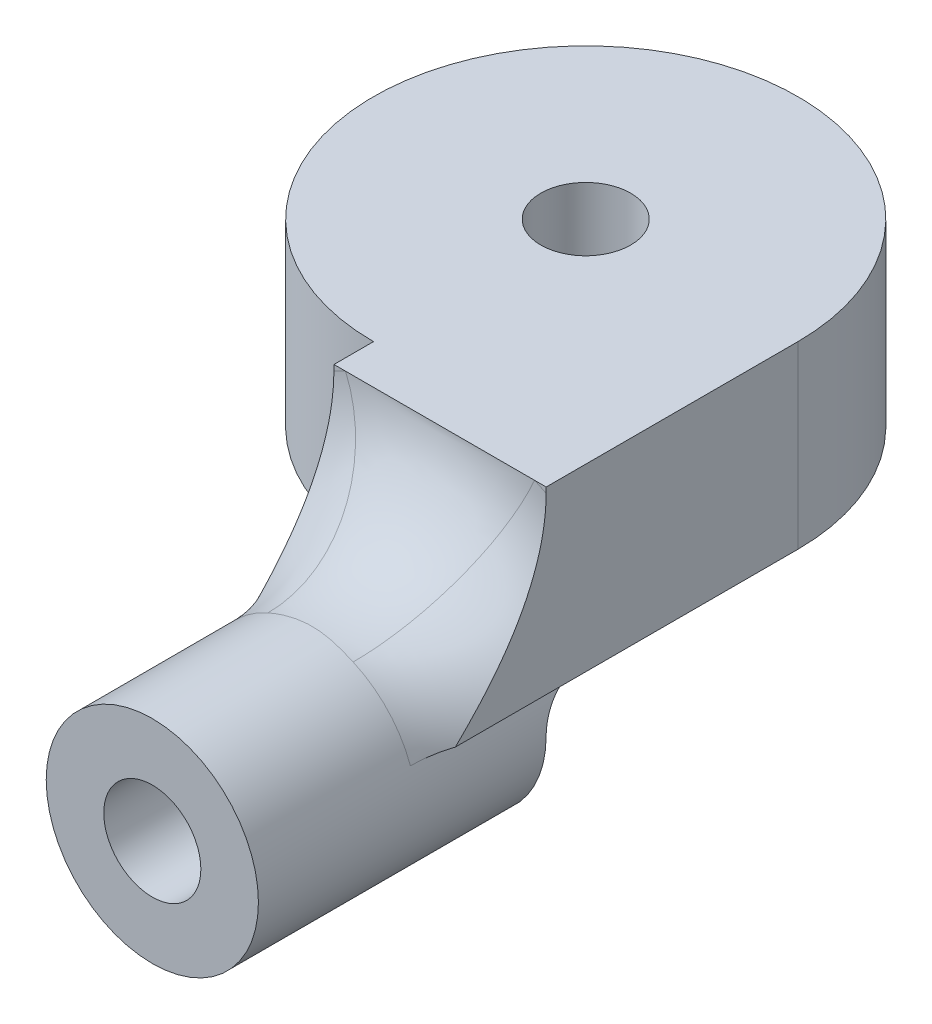
ISO-10303-21;
HEADER;
FILE_DESCRIPTION(('STEP AP214'),'2;1');
FILE_NAME('part.step','',(''),(''),'','','');
FILE_SCHEMA(('AUTOMOTIVE_DESIGN { 1 0 10303 214 1 1 1 1 }'));
ENDSEC;
DATA;
#1=APPLICATION_CONTEXT('core data for automotive mechanical design processes');
#2=APPLICATION_PROTOCOL_DEFINITION('international standard','automotive_design',2000,#1);
#3=PRODUCT_CONTEXT('',#1,'mechanical');
#4=PRODUCT('Part','Part','',(#3));
#5=PRODUCT_RELATED_PRODUCT_CATEGORY('part','',(#4));
#6=PRODUCT_DEFINITION_FORMATION('','',#4);
#7=PRODUCT_DEFINITION_CONTEXT('part definition',#1,'design');
#8=PRODUCT_DEFINITION('design','',#6,#7);
#9=PRODUCT_DEFINITION_SHAPE('','',#8);
#10=(LENGTH_UNIT() NAMED_UNIT(*) SI_UNIT(.MILLI.,.METRE.));
#11=(NAMED_UNIT(*) PLANE_ANGLE_UNIT() SI_UNIT($,.RADIAN.));
#12=(NAMED_UNIT(*) SI_UNIT($,.STERADIAN.) SOLID_ANGLE_UNIT());
#13=UNCERTAINTY_MEASURE_WITH_UNIT(LENGTH_MEASURE(1.E-05),#10,'distance_accuracy_value','');
#14=(GEOMETRIC_REPRESENTATION_CONTEXT(3) GLOBAL_UNCERTAINTY_ASSIGNED_CONTEXT((#13)) GLOBAL_UNIT_ASSIGNED_CONTEXT((#10,
#11,#12)) REPRESENTATION_CONTEXT('',''));
#15=CARTESIAN_POINT('',(0.,0.,0.));
#16=DIRECTION('',(0.,0.,1.));
#17=DIRECTION('',(1.,0.,0.));
#18=AXIS2_PLACEMENT_3D('',#15,#16,#17);
#19=CARTESIAN_POINT('',(0.,7.62,0.));
#20=DIRECTION('',(0.,0.,-1.));
#21=DIRECTION('',(-1.,0.,0.));
#22=AXIS2_PLACEMENT_3D('',#19,#20,#21);
#23=PLANE('',#22);
#24=DIRECTION('',(0.,-1.,0.));
#25=VECTOR('',#24,1.);
#26=CARTESIAN_POINT('',(-3.7465,7.62,0.));
#27=LINE('',#26,#25);
#28=CARTESIAN_POINT('',(-3.7465,7.62,0.));
#29=VERTEX_POINT('',#28);
#30=CARTESIAN_POINT('',(-3.7465,7.42705729074443,0.));
#31=VERTEX_POINT('',#30);
#32=EDGE_CURVE('E142',#29,#31,#27,.T.);
#33=ORIENTED_EDGE('',*,*,#32,.T.);
#34=CARTESIAN_POINT('',(0.,0.,0.));
#35=DIRECTION('',(0.,0.,-1.));
#36=DIRECTION('',(-1.,0.,0.));
#37=AXIS2_PLACEMENT_3D('',#34,#35,#36);
#38=CIRCLE('',#37,8.3185);
#39=CARTESIAN_POINT('',(-3.33662138247659,7.62,0.));
#40=VERTEX_POINT('',#39);
#41=EDGE_CURVE('E535',#31,#40,#38,.T.);
#42=ORIENTED_EDGE('',*,*,#41,.T.);
#43=DIRECTION('',(1.,0.,0.));
#44=VECTOR('',#43,1.);
#45=CARTESIAN_POINT('',(0.,7.62,0.));
#46=LINE('',#45,#44);
#47=EDGE_CURVE('E511',#29,#40,#46,.T.);
#48=ORIENTED_EDGE('',*,*,#47,.F.);
#49=EDGE_LOOP('',(#33,#42,#48));
#50=FACE_BOUND('',#49,.T.);
#51=ADVANCED_FACE('F37',(#50),#23,.F.);
#52=CARTESIAN_POINT('',(0.,0.,10.16));
#53=DIRECTION('',(0.,0.,1.));
#54=DIRECTION('',(1.,0.,0.));
#55=AXIS2_PLACEMENT_3D('',#52,#53,#54);
#56=PLANE('',#55);
#57=CARTESIAN_POINT('',(0.,0.,10.16));
#58=DIRECTION('',(0.,0.,1.));
#59=DIRECTION('',(1.,0.,0.));
#60=AXIS2_PLACEMENT_3D('',#57,#58,#59);
#61=CIRCLE('',#60,3.7465);
#62=CARTESIAN_POINT('',(3.7465,0.,10.16));
#63=VERTEX_POINT('',#62);
#64=EDGE_CURVE('E174',#63,#63,#61,.T.);
#65=ORIENTED_EDGE('',*,*,#64,.T.);
#66=EDGE_LOOP('',(#65));
#67=FACE_BOUND('',#66,.T.);
#68=CARTESIAN_POINT('',(0.,0.,10.16));
#69=DIRECTION('',(0.,0.,1.));
#70=DIRECTION('',(1.,0.,0.));
#71=AXIS2_PLACEMENT_3D('',#68,#69,#70);
#72=CIRCLE('',#71,1.7145);
#73=CARTESIAN_POINT('',(1.7145,0.,10.16));
#74=VERTEX_POINT('',#73);
#75=EDGE_CURVE('E169',#74,#74,#72,.T.);
#76=ORIENTED_EDGE('',*,*,#75,.F.);
#77=EDGE_LOOP('',(#76));
#78=FACE_BOUND('',#77,.T.);
#79=ADVANCED_FACE('F270',(#67,#78),#56,.T.);
#80=CARTESIAN_POINT('',(0.,0.,0.));
#81=DIRECTION('',(0.,0.,1.));
#82=DIRECTION('',(1.,0.,0.));
#83=AXIS2_PLACEMENT_3D('',#80,#81,#82);
#84=PLANE('',#83);
#85=CARTESIAN_POINT('',(0.,0.,0.));
#86=DIRECTION('',(0.,0.,1.));
#87=DIRECTION('',(1.,0.,0.));
#88=AXIS2_PLACEMENT_3D('',#85,#86,#87);
#89=CIRCLE('',#88,3.7465);
#90=CARTESIAN_POINT('',(-3.7465,0.,0.));
#91=VERTEX_POINT('',#90);
#92=CARTESIAN_POINT('',(3.7465,0.,0.));
#93=VERTEX_POINT('',#92);
#94=EDGE_CURVE('E171',#91,#93,#89,.T.);
#95=ORIENTED_EDGE('',*,*,#94,.F.);
#96=DIRECTION('',(1.,0.,0.));
#97=VECTOR('',#96,1.);
#98=CARTESIAN_POINT('',(-1.15178567884828,0.,0.));
#99=LINE('',#98,#97);
#100=CARTESIAN_POINT('',(-1.7145,0.,0.));
#101=VERTEX_POINT('',#100);
#102=EDGE_CURVE('E303',#91,#101,#99,.T.);
#103=ORIENTED_EDGE('',*,*,#102,.T.);
#104=CARTESIAN_POINT('',(0.,0.,0.));
#105=DIRECTION('',(0.,0.,1.));
#106=DIRECTION('',(1.,0.,0.));
#107=AXIS2_PLACEMENT_3D('',#104,#105,#106);
#108=CIRCLE('',#107,1.7145);
#109=CARTESIAN_POINT('',(1.7145,0.,0.));
#110=VERTEX_POINT('',#109);
#111=EDGE_CURVE('E160',#101,#110,#108,.T.);
#112=ORIENTED_EDGE('',*,*,#111,.T.);
#113=DIRECTION('',(1.,0.,0.));
#114=VECTOR('',#113,1.);
#115=CARTESIAN_POINT('',(3.52467902793999,0.,0.));
#116=LINE('',#115,#114);
#117=EDGE_CURVE('E226',#110,#93,#116,.T.);
#118=ORIENTED_EDGE('',*,*,#117,.T.);
#119=EDGE_LOOP('',(#95,#103,#112,#118));
#120=FACE_BOUND('',#119,.T.);
#121=ADVANCED_FACE('F340',(#120),#84,.F.);
#122=CARTESIAN_POINT('',(0.,0.,10.16));
#123=DIRECTION('',(0.,0.,-1.));
#124=DIRECTION('',(-1.,0.,0.));
#125=AXIS2_PLACEMENT_3D('',#122,#123,#124);
#126=CYLINDRICAL_SURFACE('',#125,3.7465);
#127=ORIENTED_EDGE('',*,*,#64,.F.);
#128=EDGE_LOOP('',(#127));
#129=FACE_BOUND('',#128,.T.);
#130=CARTESIAN_POINT('',(0.,0.,4.572));
#131=DIRECTION('',(0.,0.,-1.));
#132=DIRECTION('',(-1.,0.,0.));
#133=AXIS2_PLACEMENT_3D('',#130,#131,#132);
#134=CIRCLE('',#133,3.7465);
#135=CARTESIAN_POINT('',(-1.5027531417261,3.43190839694656,4.572));
#136=VERTEX_POINT('',#135);
#137=CARTESIAN_POINT('',(-3.52467902793999,1.27,4.572));
#138=VERTEX_POINT('',#137);
#139=EDGE_CURVE('E196',#136,#138,#134,.F.);
#140=ORIENTED_EDGE('',*,*,#139,.T.);
#141=DIRECTION('',(0.,0.,-1.));
#142=VECTOR('',#141,1.);
#143=CARTESIAN_POINT('',(-3.52467902793999,1.27,4.572));
#144=LINE('',#143,#142);
#145=CARTESIAN_POINT('',(-3.52467902793999,1.27,-1.27));
#146=VERTEX_POINT('',#145);
#147=EDGE_CURVE('E533',#138,#146,#144,.T.);
#148=ORIENTED_EDGE('',*,*,#147,.T.);
#149=CARTESIAN_POINT('',(-3.52467902793999,1.27,-1.27));
#150=CARTESIAN_POINT('',(-3.52467551141979,1.2700009902898,-1.23537706976724));
#151=CARTESIAN_POINT('',(-3.5251898251675,1.26858324531154,-1.20077185710846));
#152=CARTESIAN_POINT('',(-3.52721846548378,1.26293533176767,-1.1318307135482));
#153=CARTESIAN_POINT('',(-3.52873251368593,1.25870594607407,-1.09749471038007));
#154=CARTESIAN_POINT('',(-3.53470538398453,1.24188141013375,-0.995483295649385));
#155=CARTESIAN_POINT('',(-3.54059549873313,1.2251494088276,-0.928525615265789));
#156=CARTESIAN_POINT('',(-3.55547625006653,1.18126176661794,-0.798587402711958));
#157=CARTESIAN_POINT('',(-3.5644651176949,1.15411207176918,-0.735604625641566));
#158=CARTESIAN_POINT('',(-3.58452374617743,1.09021571623752,-0.615028828309148));
#159=CARTESIAN_POINT('',(-3.59559491323332,1.05346256365739,-0.557439489899789));
#160=CARTESIAN_POINT('',(-3.61906738128541,0.969826608964907,-0.44701267291083));
#161=CARTESIAN_POINT('',(-3.63150248662518,0.92262298171232,-0.39442542955397));
#162=CARTESIAN_POINT('',(-3.65601756421701,0.820104914392189,-0.297738138240444));
#163=CARTESIAN_POINT('',(-3.66809746364169,0.764788824766774,-0.253639820617659));
#164=CARTESIAN_POINT('',(-3.6909390069222,0.645754920040908,-0.17402259835627));
#165=CARTESIAN_POINT('',(-3.70165542465871,0.581848326967486,-0.138772081287993));
#166=CARTESIAN_POINT('',(-3.72015079511388,0.448608604553651,-0.0796425699676044));
#167=CARTESIAN_POINT('',(-3.727932556751,0.379280741355271,-0.0557526960811882));
#168=CARTESIAN_POINT('',(-3.73794300200657,0.258044692354971,-0.0254120631196585));
#169=CARTESIAN_POINT('',(-3.74112963512447,0.206960099295953,-0.0159061848732913));
#170=CARTESIAN_POINT('',(-3.74541812740578,0.103928311432396,-0.00319151700517332));
#171=CARTESIAN_POINT('',(-3.74651995734204,0.0519811045450512,1.71843355923867E-05));
#172=CARTESIAN_POINT('',(-3.7465,0.,0.));
#173=B_SPLINE_CURVE_WITH_KNOTS('',3,(#149,#150,#151,#152,#153,#154,#155,#156,#157,#158,#159,
#160,#161,#162,#163,#164,#165,#166,#167,#168,#169,#170,#171,#172),.UNSPECIFIED.,.F.,.F.,(4,2,2,
2,2,2,2,2,2,2,2,4),(0.,0.103801405808099,0.207573921296298,0.414293544442592,0.620895354349748,
0.827637189168036,1.04192669238821,1.25625982900608,1.47646967744981,1.69646821289661,
1.85223702321786,2.00800801726778),.UNSPECIFIED.);
#174=EDGE_CURVE('E278',#146,#91,#173,.T.);
#175=ORIENTED_EDGE('',*,*,#174,.T.);
#176=ORIENTED_EDGE('',*,*,#94,.T.);
#177=CARTESIAN_POINT('',(3.7465,0.,0.));
#178=CARTESIAN_POINT('',(3.74650260117181,0.0346808764586415,8.36462003206877E-07));
#179=CARTESIAN_POINT('',(3.74601787439513,0.0693442385953289,-0.00142151169551155));
#180=CARTESIAN_POINT('',(3.7441015662107,0.138405049822375,-0.00708876228888403));
#181=CARTESIAN_POINT('',(3.74267020737296,0.172802559496556,-0.0113330012493434));
#182=CARTESIAN_POINT('',(3.7370115851823,0.275020471103634,-0.0282218612655205));
#183=CARTESIAN_POINT('',(3.73141935821551,0.342127579497861,-0.0450230459974732));
#184=CARTESIAN_POINT('',(3.71718027089636,0.472373835625486,-0.0891117377810754));
#185=CARTESIAN_POINT('',(3.70853457486629,0.535514485020284,-0.116395248151192));
#186=CARTESIAN_POINT('',(3.68906617702462,0.65635469437696,-0.180605005794135));
#187=CARTESIAN_POINT('',(3.67824227601802,0.714051231307606,-0.217536568086224));
#188=CARTESIAN_POINT('',(3.65512669221314,0.82437393067404,-0.301361542531086));
#189=CARTESIAN_POINT('',(3.64279917395521,0.87677932311915,-0.348535427216729));
#190=CARTESIAN_POINT('',(3.61825816874598,0.97311129117496,-0.450917326756902));
#191=CARTESIAN_POINT('',(3.60604471852328,1.01703521973261,-0.506127840433574));
#192=CARTESIAN_POINT('',(3.58271257113477,1.09644992733464,-0.625048163284352));
#193=CARTESIAN_POINT('',(3.57163820647491,1.1316451676076,-0.688964668012462));
#194=CARTESIAN_POINT('',(3.55239948563874,1.190667461744,-0.82221850036134));
#195=CARTESIAN_POINT('',(3.54423198790606,1.21450679783531,-0.891549876473136));
#196=CARTESIAN_POINT('',(3.53370927691445,1.24472535838696,-1.01265221825444));
#197=CARTESIAN_POINT('',(3.53035102375469,1.25417794068246,-1.06358874757814));
#198=CARTESIAN_POINT('',(3.52582318061235,1.26682475319856,-1.1663379990158));
#199=CARTESIAN_POINT('',(3.5246540860093,1.27001756691859,-1.21815091676978));
#200=CARTESIAN_POINT('',(3.52467902793999,1.27,-1.27));
#201=B_SPLINE_CURVE_WITH_KNOTS('',3,(#177,#178,#179,#180,#181,#182,#183,#184,#185,#186,#187,
#188,#189,#190,#191,#192,#193,#194,#195,#196,#197,#198,#199,#200),.UNSPECIFIED.,.F.,.F.,(4,2,2,
2,2,2,2,2,2,2,2,4),(0.,0.103975807805818,0.207927177739375,0.4150563426526,0.622106611992641,
0.829271184753287,1.04305170250601,1.25689883340032,1.4772195223836,1.69730137456618,
1.85263679283544,2.0080073573441),.UNSPECIFIED.);
#202=CARTESIAN_POINT('',(3.52467902793999,1.27,-1.27));
#203=VERTEX_POINT('',#202);
#204=EDGE_CURVE('E50',#93,#203,#201,.T.);
#205=ORIENTED_EDGE('',*,*,#204,.T.);
#206=DIRECTION('',(0.,0.,-1.));
#207=VECTOR('',#206,1.);
#208=CARTESIAN_POINT('',(3.52467902793999,1.27,0.));
#209=LINE('',#208,#207);
#210=CARTESIAN_POINT('',(3.52467902793999,1.27,4.572));
#211=VERTEX_POINT('',#210);
#212=EDGE_CURVE('E177',#203,#211,#209,.F.);
#213=ORIENTED_EDGE('',*,*,#212,.T.);
#214=CARTESIAN_POINT('',(0.,0.,4.572));
#215=DIRECTION('',(0.,0.,-1.));
#216=DIRECTION('',(-1.,0.,0.));
#217=AXIS2_PLACEMENT_3D('',#214,#215,#216);
#218=CIRCLE('',#217,3.7465);
#219=CARTESIAN_POINT('',(1.5027531417261,3.43190839694656,4.572));
#220=VERTEX_POINT('',#219);
#221=EDGE_CURVE('E186',#211,#220,#218,.F.);
#222=ORIENTED_EDGE('',*,*,#221,.T.);
#223=CARTESIAN_POINT('',(2.02847506857651,3.14984938467914,4.52890429575409));
#224=CARTESIAN_POINT('',(1.70629066354551,3.3573332841533,-0.589450715656693));
#225=CARTESIAN_POINT('',(4.50390227090716,7.62,0.));
#226=CARTESIAN_POINT('',(1.94607245369308,3.2029357311331,4.54512957665234));
#227=CARTESIAN_POINT('',(1.69982969048028,3.35005406353562,-0.478285669951793));
#228=CARTESIAN_POINT('',(4.32094053278385,7.62,0.));
#229=CARTESIAN_POINT('',(1.8614631594562,3.25282897419113,4.55583455260318));
#230=CARTESIAN_POINT('',(1.67889729708073,3.35557034968474,-0.372623325720961));
#231=CARTESIAN_POINT('',(4.13307921846193,7.62,0.));
#232=CARTESIAN_POINT('',(1.68855358312247,3.3458398452382,4.56919401951259));
#233=CARTESIAN_POINT('',(1.61140738962111,3.38291169064701,-0.177820721524429));
#234=CARTESIAN_POINT('',(3.74916134558218,7.62,0.));
#235=CARTESIAN_POINT('',(1.60025631234802,3.38896286945571,4.57185495320795));
#236=CARTESIAN_POINT('',(1.56532120073966,3.40442364795939,-0.088176153833044));
#237=CARTESIAN_POINT('',(3.55311147318083,7.62,0.));
#238=CARTESIAN_POINT('',(1.42062218849538,3.46810225132448,4.57213276179));
#239=CARTESIAN_POINT('',(1.45102375269723,3.45463992355778,0.0730185975899158));
#240=CARTESIAN_POINT('',(3.15426282530197,7.62,0.));
#241=CARTESIAN_POINT('',(1.32928751581187,3.5041235834969,4.56975318122508));
#242=CARTESIAN_POINT('',(1.3830766460804,3.48327364808713,0.145082681130852));
#243=CARTESIAN_POINT('',(2.95146889103977,7.62,0.));
#244=CARTESIAN_POINT('',(1.14407575243789,3.56889014069538,4.562441890533));
#245=CARTESIAN_POINT('',(1.22951323452347,3.54102435806797,0.271844310173531));
#246=CARTESIAN_POINT('',(2.54023599270165,7.62,0.));
#247=CARTESIAN_POINT('',(1.05019814188851,3.59763386532445,4.55750965477152));
#248=CARTESIAN_POINT('',(1.14393286661081,3.57021522863332,0.326965415772105));
#249=CARTESIAN_POINT('',(2.33179587436277,7.62,0.));
#250=CARTESIAN_POINT('',(0.858769521923438,3.64811624169302,4.54708241450258));
#251=CARTESIAN_POINT('',(0.957825396404587,3.62471091487557,0.42179823199684));
#252=CARTESIAN_POINT('',(1.90675944698241,7.62,0.));
#253=CARTESIAN_POINT('',(0.761182795004,3.66971913747683,4.54157886136446));
#254=CARTESIAN_POINT('',(0.856893729837544,3.65008066101771,0.461566911417397));
#255=CARTESIAN_POINT('',(1.69008383297502,7.62,0.));
#256=CARTESIAN_POINT('',(0.56458372427859,3.70506168207007,4.53176757116625));
#257=CARTESIAN_POINT('',(0.645789044993283,3.69287637146484,0.525584600453253));
#258=CARTESIAN_POINT('',(1.25356725221191,7.62,0.));
#259=CARTESIAN_POINT('',(0.465571393247379,3.71880140129609,4.52745982339762));
#260=CARTESIAN_POINT('',(0.535326463486733,3.71043957696984,0.550068001907751));
#261=CARTESIAN_POINT('',(1.03372631382048,7.62,0.));
#262=CARTESIAN_POINT('',(0.266765042353368,3.73832487800842,4.52114944947836));
#263=CARTESIAN_POINT('',(0.309580809329482,3.73562482536011,0.58453269180036));
#264=CARTESIAN_POINT('',(0.592308822852361,7.62,0.));
#265=CARTESIAN_POINT('',(0.166971151151121,3.74410991841503,4.51914645162916));
#266=CARTESIAN_POINT('',(0.193915198631663,3.74333773767367,0.594642460799426));
#267=CARTESIAN_POINT('',(0.370732555945698,7.62,0.));
#268=CARTESIAN_POINT('',(-0.0327653325125049,3.74768811665468,4.517920352614));
#269=CARTESIAN_POINT('',(-0.0379483268517515,3.7480702399343,0.600886833964575));
#270=CARTESIAN_POINT('',(-0.0727501450701262,7.62,0.));
#271=CARTESIAN_POINT('',(-0.132707929284684,3.74548103810883,4.51869733367007));
#272=CARTESIAN_POINT('',(-0.154569505874384,3.74510689882468,0.597043854243316));
#273=CARTESIAN_POINT('',(-0.294656588750726,7.62,0.));
#274=CARTESIAN_POINT('',(-0.336942185241151,3.73278756768615,4.52295330031824));
#275=CARTESIAN_POINT('',(-0.389704175847612,3.7284728866973,0.57479251272231));
#276=CARTESIAN_POINT('',(-0.748125868925282,7.62,0.));
#277=CARTESIAN_POINT('',(-0.441208747230224,3.72190341199142,4.52656196425942));
#278=CARTESIAN_POINT('',(-0.508476172496318,3.71422238749317,0.555595652559002));
#279=CARTESIAN_POINT('',(-0.979632981138343,7.62,0.));
#280=CARTESIAN_POINT('',(-0.648452055395365,3.69144187440801,4.53566709494405));
#281=CARTESIAN_POINT('',(-0.737056319316469,3.67619651070218,0.501065727051287));
#282=CARTESIAN_POINT('',(-1.4397833772338,7.62,0.));
#283=CARTESIAN_POINT('',(-0.751428708895983,3.67186387153835,4.54116369653207));
#284=CARTESIAN_POINT('',(-0.847248413166816,3.65227935887497,0.465511835456308));
#285=CARTESIAN_POINT('',(-1.66842645534528,7.62,0.));
#286=CARTESIAN_POINT('',(-0.955344003727895,3.62416079317871,4.55234012482855));
#287=CARTESIAN_POINT('',(-1.05375412427631,3.59827790417947,0.377113332723662));
#288=CARTESIAN_POINT('',(-2.12118753370096,7.62,0.));
#289=CARTESIAN_POINT('',(-1.05628329905605,3.59603850849883,4.55801989116945));
#290=CARTESIAN_POINT('',(-1.15030418161015,3.56802759220772,0.323920451879797));
#291=CARTESIAN_POINT('',(-2.34530698603989,7.62,0.));
#292=CARTESIAN_POINT('',(-1.25547430403665,3.53143129394279,4.56722223982201));
#293=CARTESIAN_POINT('',(-1.32466166365388,3.50646996156692,0.198969646563733));
#294=CARTESIAN_POINT('',(-2.78757853947106,7.62,0.));
#295=CARTESIAN_POINT('',(-1.3537261250424,3.49494671114094,4.57074491164086));
#296=CARTESIAN_POINT('',(-1.40248817403093,3.47504253994331,0.126725381966055));
#297=CARTESIAN_POINT('',(-3.00573088780539,7.62,0.));
#298=CARTESIAN_POINT('',(-1.53149280816575,3.42031446732329,4.57255306060283));
#299=CARTESIAN_POINT('',(-1.52390607705249,3.42301403370248,-0.0237725394415804));
#300=CARTESIAN_POINT('',(-3.40043318423294,7.62,0.));
#301=CARTESIAN_POINT('',(-1.61150489158687,3.38335153356898,4.57158155256324));
#302=CARTESIAN_POINT('',(-1.57096273211064,3.40144439527557,-0.0998137121095394));
#303=CARTESIAN_POINT('',(-3.57808713216925,7.62,0.));
#304=CARTESIAN_POINT('',(-1.76865563528914,3.30391725215962,4.564012288366));
#305=CARTESIAN_POINT('',(-1.6457531358805,3.36848164127127,-0.265053551582832));
#306=CARTESIAN_POINT('',(-3.92701505462345,7.62,0.));
#307=CARTESIAN_POINT('',(-1.84579560648529,3.26144845821502,4.55741713269031));
#308=CARTESIAN_POINT('',(-1.67321516142549,3.35723694577907,-0.354616049828369));
#309=CARTESIAN_POINT('',(-4.09829193981703,7.62,0.));
#310=CARTESIAN_POINT('',(-1.99690753898651,3.17117787199631,4.53632480558877));
#311=CARTESIAN_POINT('',(-1.70667781419008,3.35200387831233,-0.545336469189568));
#312=CARTESIAN_POINT('',(-4.43381165436613,7.62,0.));
#313=CARTESIAN_POINT('',(-2.07087246311288,3.12336500253665,4.52181096944029));
#314=CARTESIAN_POINT('',(-1.71222581998939,3.35839035178787,-0.646844037978488));
#315=CARTESIAN_POINT('',(-4.59803885879951,7.62,0.));
#316=CARTESIAN_POINT('',(-2.2149846175485,3.02289225128455,4.48231966946328));
#317=CARTESIAN_POINT('',(-1.70136514488765,3.39642233052033,-0.856791352086905));
#318=CARTESIAN_POINT('',(-4.91801669323848,7.62,0.));
#319=CARTESIAN_POINT('',(-2.28512620683226,2.97022550042168,4.45732719351743));
#320=CARTESIAN_POINT('',(-1.68445987897611,3.42864228611855,-0.965413575997109));
#321=CARTESIAN_POINT('',(-5.07375479825524,7.62,0.));
#322=CARTESIAN_POINT('',(-2.353010468251,2.91540803084254,4.42583554068407));
#323=CARTESIAN_POINT('',(-1.65659529942642,3.4774810460628,-1.07339396679136));
#324=CARTESIAN_POINT('',(-5.22448087018443,7.62,0.));
#325=(BOUNDED_SURFACE() B_SPLINE_SURFACE(3,2,((#223,#224,#225),(#226,#227,#228),(#229,#230,
#231),(#232,#233,#234),(#235,#236,#237),(#238,#239,#240),(#241,#242,#243),(#244,#245,#246),
(#247,#248,#249),(#250,#251,#252),(#253,#254,#255),(#256,#257,#258),(#259,#260,#261),(#262,#263,
#264),(#265,#266,#267),(#268,#269,#270),(#271,#272,#273),(#274,#275,#276),(#277,#278,#279),
(#280,#281,#282),(#283,#284,#285),(#286,#287,#288),(#289,#290,#291),(#292,#293,#294),(#295,#296,
#297),(#298,#299,#300),(#301,#302,#303),(#304,#305,#306),(#307,#308,#309),(#310,#311,#312),
(#313,#314,#315),(#316,#317,#318),(#319,#320,#321),(#322,#323,#324)),.UNSPECIFIED.,.F.,.F.,
.F.) B_SPLINE_SURFACE_WITH_KNOTS((4,2,2,2,2,2,2,2,2,2,2,2,2,2,2,2,4),(3,3),(0.,
0.654316420569199,1.30810863866353,1.96144125508485,2.61490845715571,3.28016664818615,
3.94541888158026,4.61056381136662,5.27572841397161,5.97326968707715,6.6708607919246,
7.36822428780647,8.06555884509654,8.65212601474186,9.23842209153964,9.82595680414836,
10.414336134212),(0.,1.),
.UNSPECIFIED.) GEOMETRIC_REPRESENTATION_ITEM() RATIONAL_B_SPLINE_SURFACE(((1.,0.665145061768971,
1.),(1.,0.672570762917956,1.),(1.,0.67982125425068,1.),(1.,0.693715384382949,1.),(1.,
0.700359504705894,1.),(1.,0.712792789395896,1.),(1.,0.718582551494967,1.),(1.,0.729139685502109,
1.),(1.,0.733906846553469,1.),(1.,0.742359078006378,1.),(1.,0.746023071376118,1.),(1.,
0.752051940663699,1.),(1.,0.754416828215329,1.),(1.,0.757785016339958,1.),(1.,0.758788536472181,
1.),(1.,0.759408721499303,1.),(1.,0.759025345374668,1.),(1.,0.756829117290252,1.),(1.,
0.754947594363425,1.),(1.,0.749723521231599,1.),(1.,0.746380866661686,1.),(1.,0.738334261456984,
1.),(1.,0.733630755339657,1.),(1.,0.723007111356775,1.),(1.,0.717087023986058,1.),(1.,
0.705254482780663,1.),(1.,0.69949018853261,1.),(1.,0.687406008887464,1.),(1.,0.68108638149833,
1.),(1.,0.668072985989567,1.),(1.,0.661378455649391,1.),(1.,0.647880123696576,1.),(1.,
0.641076178834539,1.),(1.,0.63435404803645,1.))) REPRESENTATION_ITEM('') SURFACE());
#326=CARTESIAN_POINT('',(2.02847506857651,3.14984938467914,4.52890429575409));
#327=CARTESIAN_POINT('',(1.94607245369308,3.2029357311331,4.54512957665234));
#328=CARTESIAN_POINT('',(1.8614631594562,3.25282897419113,4.55583455260318));
#329=CARTESIAN_POINT('',(1.68855358312247,3.3458398452382,4.56919401951259));
#330=CARTESIAN_POINT('',(1.60025631234802,3.38896286945571,4.57185495320795));
#331=CARTESIAN_POINT('',(1.42062218849538,3.46810225132448,4.57213276179));
#332=CARTESIAN_POINT('',(1.32928751581187,3.5041235834969,4.56975318122508));
#333=CARTESIAN_POINT('',(1.14407575243789,3.56889014069538,4.562441890533));
#334=CARTESIAN_POINT('',(1.05019814188851,3.59763386532445,4.55750965477152));
#335=CARTESIAN_POINT('',(0.858769521923438,3.64811624169302,4.54708241450258));
#336=CARTESIAN_POINT('',(0.761182795004,3.66971913747683,4.54157886136446));
#337=CARTESIAN_POINT('',(0.56458372427859,3.70506168207007,4.53176757116625));
#338=CARTESIAN_POINT('',(0.465571393247379,3.71880140129609,4.52745982339762));
#339=CARTESIAN_POINT('',(0.266765042353368,3.73832487800842,4.52114944947836));
#340=CARTESIAN_POINT('',(0.166971151151121,3.74410991841503,4.51914645162916));
#341=CARTESIAN_POINT('',(-0.0327653325125049,3.74768811665469,4.517920352614));
#342=CARTESIAN_POINT('',(-0.132707929284684,3.74548103810883,4.51869733367007));
#343=CARTESIAN_POINT('',(-0.336942185241151,3.73278756768615,4.52295330031824));
#344=CARTESIAN_POINT('',(-0.441208747230224,3.72190341199142,4.52656196425942));
#345=CARTESIAN_POINT('',(-0.648452055395365,3.69144187440801,4.53566709494405));
#346=CARTESIAN_POINT('',(-0.751428708895983,3.67186387153835,4.54116369653207));
#347=CARTESIAN_POINT('',(-0.955344003727895,3.62416079317871,4.55234012482855));
#348=CARTESIAN_POINT('',(-1.05628329905605,3.59603850849883,4.55801989116945));
#349=CARTESIAN_POINT('',(-1.25547430403665,3.53143129394279,4.56722223982201));
#350=CARTESIAN_POINT('',(-1.3537261250424,3.49494671114094,4.57074491164087));
#351=CARTESIAN_POINT('',(-1.53149280816575,3.42031446732329,4.57255306060283));
#352=CARTESIAN_POINT('',(-1.61150489158687,3.38335153356898,4.57158155256324));
#353=CARTESIAN_POINT('',(-1.76865563528914,3.30391725215962,4.564012288366));
#354=CARTESIAN_POINT('',(-1.84579560648529,3.26144845821502,4.55741713269031));
#355=CARTESIAN_POINT('',(-1.99690753898651,3.17117787199631,4.53632480558876));
#356=CARTESIAN_POINT('',(-2.07087246311288,3.12336500253665,4.52181096944029));
#357=CARTESIAN_POINT('',(-2.2149846175485,3.02289225128455,4.48231966946328));
#358=CARTESIAN_POINT('',(-2.28512620683226,2.97022550042168,4.45732719351743));
#359=CARTESIAN_POINT('',(-2.353010468251,2.91540803084254,4.42583554068407));
#360=B_SPLINE_CURVE_WITH_KNOTS('',3,(#326,#327,#328,#329,#330,#331,#332,#333,#334,#335,#336,
#337,#338,#339,#340,#341,#342,#343,#344,#345,#346,#347,#348,#349,#350,#351,#352,#353,#354,#355,
#356,#357,#358,#359),.UNSPECIFIED.,.F.,.F.,(4,2,2,2,2,2,2,2,2,2,2,2,2,2,2,2,4),(0.,
0.654316420569199,1.30810863866353,1.96144125508485,2.61490845715571,3.28016664818615,
3.94541888158026,4.61056381136662,5.27572841397161,5.97326968707715,6.6708607919246,
7.36822428780647,8.06555884509654,8.65212601474186,9.23842209153964,9.82595680414836,
10.414336134212),.UNSPECIFIED.);
#361=EDGE_CURVE('E189',#220,#136,#360,.T.);
#362=ORIENTED_EDGE('',*,*,#361,.T.);
#363=EDGE_LOOP('',(#140,#148,#175,#176,#205,#213,#222,#362));
#364=FACE_BOUND('',#363,.T.);
#365=ADVANCED_FACE('F198',(#129,#364),#126,.T.);
#366=CARTESIAN_POINT('',(0.,0.,10.16));
#367=DIRECTION('',(0.,0.,-1.));
#368=DIRECTION('',(-1.,0.,0.));
#369=AXIS2_PLACEMENT_3D('',#366,#367,#368);
#370=CYLINDRICAL_SURFACE('',#369,1.7145);
#371=ORIENTED_EDGE('',*,*,#75,.T.);
#372=EDGE_LOOP('',(#371));
#373=FACE_BOUND('',#372,.T.);
#374=CARTESIAN_POINT('',(1.15178567884828,1.27,0.));
#375=VERTEX_POINT('',#374);
#376=CARTESIAN_POINT('',(-1.15178567884828,1.27,0.));
#377=VERTEX_POINT('',#376);
#378=EDGE_CURVE('E163',#375,#377,#108,.T.);
#379=ORIENTED_EDGE('',*,*,#378,.F.);
#380=DIRECTION('',(0.,0.,-1.));
#381=VECTOR('',#380,1.);
#382=CARTESIAN_POINT('',(1.15178567884828,1.27,-1.27));
#383=LINE('',#382,#381);
#384=CARTESIAN_POINT('',(1.15178567884828,1.27,-1.27));
#385=VERTEX_POINT('',#384);
#386=EDGE_CURVE('E300',#385,#375,#383,.F.);
#387=ORIENTED_EDGE('',*,*,#386,.F.);
#388=CARTESIAN_POINT('',(1.15178567884828,1.27,-1.27));
#389=CARTESIAN_POINT('',(1.15176709652935,1.2700065470563,-1.23990809004068));
#390=CARTESIAN_POINT('',(1.15296608038192,1.26892997580001,-1.20984255563327));
#391=CARTESIAN_POINT('',(1.15763197523181,1.26467962338882,-1.1500951881326));
#392=CARTESIAN_POINT('',(1.16109440452531,1.26150998645407,-1.12041271475183));
#393=CARTESIAN_POINT('',(1.17451524843893,1.24906870245116,-1.03303292638582));
#394=CARTESIAN_POINT('',(1.18751613903429,1.23686062444994,-0.976194972298672));
#395=CARTESIAN_POINT('',(1.21921276674955,1.20561703984832,-0.866737755900715));
#396=CARTESIAN_POINT('',(1.23786670333313,1.18663147084778,-0.814090994024549));
#397=CARTESIAN_POINT('',(1.27868868564185,1.14252932208814,-0.712691344724121));
#398=CARTESIAN_POINT('',(1.30086928110054,1.11739066718519,-0.66395333555731));
#399=CARTESIAN_POINT('',(1.35148374121443,1.05588249811342,-0.56128273176573));
#400=CARTESIAN_POINT('',(1.3802788258603,1.01827139106128,-0.508272757250304));
#401=CARTESIAN_POINT('',(1.43774258070263,0.935390902833199,-0.408519418650866));
#402=CARTESIAN_POINT('',(1.46641117672488,0.890117517753852,-0.361779353900476));
#403=CARTESIAN_POINT('',(1.5270030840932,0.782495567418301,-0.266642319543804));
#404=CARTESIAN_POINT('',(1.5584551337617,0.718540191411869,-0.219732543567538));
#405=CARTESIAN_POINT('',(1.61481656774958,0.580839594181832,-0.137788978388617));
#406=CARTESIAN_POINT('',(1.63973760183882,0.507112162743128,-0.102734010143002));
#407=CARTESIAN_POINT('',(1.67396041721541,0.374926276046182,-0.0552101404490289));
#408=CARTESIAN_POINT('',(1.68570118378181,0.31838141521007,-0.0391288858387321));
#409=CARTESIAN_POINT('',(1.70345834722685,0.202808372145792,-0.0149183163809121));
#410=CARTESIAN_POINT('',(1.70948984132605,0.143787172765354,-0.00676802780448771));
#411=CARTESIAN_POINT('',(1.71311352192964,0.0703779409547231,-0.00187246080360173));
#412=CARTESIAN_POINT('',(1.71363328727821,0.0563107610451696,-0.00117036130419834));
#413=CARTESIAN_POINT('',(1.71432601913164,0.028164063583309,-0.000234750573729945));
#414=CARTESIAN_POINT('',(1.71449927517991,0.0140845661749878,-8.48116760205194E-07));
#415=CARTESIAN_POINT('',(1.7145,0.,0.));
#416=B_SPLINE_CURVE_WITH_KNOTS('',3,(#388,#389,#390,#391,#392,#393,#394,#395,#396,#397,#398,
#399,#400,#401,#402,#403,#404,#405,#406,#407,#408,#409,#410,#411,#412,#413,#414,#415),
.UNSPECIFIED.,.F.,.F.,(4,2,2,2,2,2,2,2,2,2,2,2,2,4),(0.,0.0901859305075427,0.180193828290853,
0.357829439262193,0.534182339071857,0.711177452294949,0.92371989394891,1.13637374396515,
1.39091619845297,1.64500147113223,1.82411527617616,2.00275411043963,2.04503002200868,
2.08727059301339),.UNSPECIFIED.);
#417=EDGE_CURVE('E11',#385,#110,#416,.T.);
#418=ORIENTED_EDGE('',*,*,#417,.T.);
#419=ORIENTED_EDGE('',*,*,#111,.F.);
#420=CARTESIAN_POINT('',(-1.7145,0.,0.));
#421=CARTESIAN_POINT('',(-1.71450398504711,0.0312907341074102,3.05287612461261E-06));
#422=CARTESIAN_POINT('',(-1.71364254217327,0.0625634039284616,-0.00115732175113637));
#423=CARTESIAN_POINT('',(-1.71023325666738,0.124827943257971,-0.00576461304905331));
#424=CARTESIAN_POINT('',(-1.70768647831269,0.155819977473572,-0.00921008669895939));
#425=CARTESIAN_POINT('',(-1.69763392569646,0.247603615787678,-0.0228470051286665));
#426=CARTESIAN_POINT('',(-1.68771448267587,0.307681691090349,-0.0363403509472621));
#427=CARTESIAN_POINT('',(-1.66231516981742,0.423989197483805,-0.0713238008550541));
#428=CARTESIAN_POINT('',(-1.64684719263383,0.480226556146069,-0.0927968049648212));
#429=CARTESIAN_POINT('',(-1.61150055798008,0.588048195904404,-0.142775052565597));
#430=CARTESIAN_POINT('',(-1.59161575721141,0.639625853938957,-0.171290096970781));
#431=CARTESIAN_POINT('',(-1.54676341145403,0.741909900352714,-0.237281326658746));
#432=CARTESIAN_POINT('',(-1.52149777739604,0.792108304484139,-0.275337423935762));
#433=CARTESIAN_POINT('',(-1.46891302153365,0.885832179544782,-0.357802395240994));
#434=CARTESIAN_POINT('',(-1.44159117820265,0.92934856642336,-0.402219761568158));
#435=CARTESIAN_POINT('',(-1.38124951939516,1.01736694373678,-0.506200213269284));
#436=CARTESIAN_POINT('',(-1.34817415960885,1.06035322180074,-0.567020080459156));
#437=CARTESIAN_POINT('',(-1.28539259715785,1.13563565774969,-0.696565850493239));
#438=CARTESIAN_POINT('',(-1.25568220104417,1.16794521958655,-0.765281693160074));
#439=CARTESIAN_POINT('',(-1.21322811593876,1.21168964541925,-0.886128321759035));
#440=CARTESIAN_POINT('',(-1.19812510198124,1.22649386191284,-0.93620363575356));
#441=CARTESIAN_POINT('',(-1.17366481826431,1.24992563449916,-1.03904275642163));
#442=CARTESIAN_POINT('',(-1.16428545228669,1.25857696557987,-1.09179536143404));
#443=CARTESIAN_POINT('',(-1.15629955163199,1.26589441099465,-1.16586033626793));
#444=CARTESIAN_POINT('',(-1.15461416583502,1.26743020208855,-1.1866037042055));
#445=CARTESIAN_POINT('',(-1.1523553083099,1.26948383740538,-1.22822778807404));
#446=CARTESIAN_POINT('',(-1.15178327976082,1.27000036042345,-1.24910864711527));
#447=CARTESIAN_POINT('',(-1.15178567884828,1.27,-1.27));
#448=B_SPLINE_CURVE_WITH_KNOTS('',3,(#420,#421,#422,#423,#424,#425,#426,#427,#428,#429,#430,
#431,#432,#433,#434,#435,#436,#437,#438,#439,#440,#441,#442,#443,#444,#445,#446,#447),
.UNSPECIFIED.,.F.,.F.,(4,2,2,2,2,2,2,2,2,2,2,2,2,4),(0.,0.0938044276884722,0.187549675003768,
0.373624568092543,0.559302990751013,0.745241306372945,0.948128699420691,1.15128951675848,
1.39473671794624,1.63787711479868,1.80039902076027,1.96228947266035,2.02484825714525,
2.08748807901417),.UNSPECIFIED.);
#449=CARTESIAN_POINT('',(-1.15178567884828,1.27,-1.27));
#450=VERTEX_POINT('',#449);
#451=EDGE_CURVE('E62',#101,#450,#448,.T.);
#452=ORIENTED_EDGE('',*,*,#451,.T.);
#453=DIRECTION('',(0.,0.,-1.));
#454=VECTOR('',#453,1.);
#455=CARTESIAN_POINT('',(-1.15178567884828,1.27,0.));
#456=LINE('',#455,#454);
#457=EDGE_CURVE('E57',#377,#450,#456,.T.);
#458=ORIENTED_EDGE('',*,*,#457,.F.);
#459=EDGE_LOOP('',(#379,#387,#418,#419,#452,#458));
#460=FACE_BOUND('',#459,.T.);
#461=ADVANCED_FACE('F265',(#373,#460),#370,.F.);
#462=DIRECTION('',(1.,0.,0.));
#463=VECTOR('',#462,1.);
#464=CARTESIAN_POINT('',(0.,1.27,0.));
#465=LINE('',#464,#463);
#466=EDGE_CURVE('E347',#377,#375,#465,.T.);
#467=ORIENTED_EDGE('',*,*,#466,.T.);
#468=ORIENTED_EDGE('',*,*,#378,.T.);
#469=EDGE_LOOP('',(#467,#468));
#470=FACE_BOUND('',#469,.T.);
#471=ADVANCED_FACE('F264',(#470),#23,.F.);
#472=CARTESIAN_POINT('',(-3.7465,7.62,-8.89));
#473=DIRECTION('',(0.,-1.,0.));
#474=DIRECTION('',(0.,0.,-1.));
#475=AXIS2_PLACEMENT_3D('',#472,#473,#474);
#476=CYLINDRICAL_SURFACE('',#475,7.493);
#477=CARTESIAN_POINT('',(-3.7465,1.27,-8.89));
#478=DIRECTION('',(0.,1.,0.));
#479=DIRECTION('',(0.,0.,1.));
#480=AXIS2_PLACEMENT_3D('',#477,#478,#479);
#481=CIRCLE('',#480,7.493);
#482=CARTESIAN_POINT('',(3.7465,1.27,-8.89));
#483=VERTEX_POINT('',#482);
#484=CARTESIAN_POINT('',(-3.7465,1.27,-1.397));
#485=VERTEX_POINT('',#484);
#486=EDGE_CURVE('E159',#483,#485,#481,.T.);
#487=ORIENTED_EDGE('',*,*,#486,.T.);
#488=DIRECTION('',(0.,-1.,0.));
#489=VECTOR('',#488,1.);
#490=CARTESIAN_POINT('',(-3.7465,7.62,-1.397));
#491=LINE('',#490,#489);
#492=CARTESIAN_POINT('',(-3.7465,7.62,-1.397));
#493=VERTEX_POINT('',#492);
#494=EDGE_CURVE('E139',#493,#485,#491,.T.);
#495=ORIENTED_EDGE('',*,*,#494,.F.);
#496=CARTESIAN_POINT('',(-3.7465,7.62,-8.89));
#497=DIRECTION('',(0.,1.,0.));
#498=DIRECTION('',(0.,0.,1.));
#499=AXIS2_PLACEMENT_3D('',#496,#497,#498);
#500=CIRCLE('',#499,7.493);
#501=CARTESIAN_POINT('',(3.7465,7.62,-8.89));
#502=VERTEX_POINT('',#501);
#503=EDGE_CURVE('E147',#502,#493,#500,.T.);
#504=ORIENTED_EDGE('',*,*,#503,.F.);
#505=DIRECTION('',(0.,-1.,0.));
#506=VECTOR('',#505,1.);
#507=CARTESIAN_POINT('',(3.7465,7.62,-8.89));
#508=LINE('',#507,#506);
#509=EDGE_CURVE('E515',#502,#483,#508,.T.);
#510=ORIENTED_EDGE('',*,*,#509,.T.);
#511=EDGE_LOOP('',(#487,#495,#504,#510));
#512=FACE_BOUND('',#511,.T.);
#513=ADVANCED_FACE('F157',(#512),#476,.T.);
#514=CARTESIAN_POINT('',(-3.7465,7.62,0.));
#515=DIRECTION('',(1.,0.,0.));
#516=DIRECTION('',(0.,0.,-1.));
#517=AXIS2_PLACEMENT_3D('',#514,#515,#516);
#518=PLANE('',#517);
#519=DIRECTION('',(0.,0.,1.));
#520=VECTOR('',#519,1.);
#521=CARTESIAN_POINT('',(-3.7465,1.27,0.));
#522=LINE('',#521,#520);
#523=CARTESIAN_POINT('',(-3.7465,1.27,3.20418258785179));
#524=VERTEX_POINT('',#523);
#525=EDGE_CURVE('E348',#485,#524,#522,.T.);
#526=ORIENTED_EDGE('',*,*,#525,.T.);
#527=CARTESIAN_POINT('',(-3.7465,1.27,3.20418258785179));
#528=CARTESIAN_POINT('',(-3.7465,1.48838475554214,2.98051010371764));
#529=CARTESIAN_POINT('',(-3.7465,1.71131953407618,2.76079161736588));
#530=CARTESIAN_POINT('',(-3.7465,2.17032688217616,2.33337296550144));
#531=CARTESIAN_POINT('',(-3.7465,2.406456557952,2.12573450124195));
#532=CARTESIAN_POINT('',(-3.7465,2.898814768892,1.72478202221972));
#533=CARTESIAN_POINT('',(-3.7465,3.15535329679466,1.53184283144046));
#534=CARTESIAN_POINT('',(-3.7465,3.68542743708692,1.17168635000055));
#535=CARTESIAN_POINT('',(-3.7465,3.95892758528746,1.0044177731708));
#536=CARTESIAN_POINT('',(-3.7465,4.40956284226211,0.762864363363192));
#537=CARTESIAN_POINT('',(-3.7465,4.58118771335236,0.678248235872461));
#538=CARTESIAN_POINT('',(-3.7465,4.93031742809317,0.521906455134719));
#539=CARTESIAN_POINT('',(-3.7465,5.10782393932327,0.450184495362888));
#540=CARTESIAN_POINT('',(-3.7465,5.46650717101205,0.32169582067244));
#541=CARTESIAN_POINT('',(-3.7465,5.64764037446334,0.264808206999207));
#542=CARTESIAN_POINT('',(-3.7465,6.01401245433528,0.166618236221042));
#543=CARTESIAN_POINT('',(-3.7465,6.19924906413004,0.125307491417507));
#544=CARTESIAN_POINT('',(-3.7465,6.55733294733481,0.0622487526616254));
#545=CARTESIAN_POINT('',(-3.7465,6.72994436440701,0.0391699638415915));
#546=CARTESIAN_POINT('',(-3.7465,7.07735826527761,0.00799660589040675));
#547=CARTESIAN_POINT('',(-3.7465,7.25216734459287,-2.38737817097095E-05));
#548=CARTESIAN_POINT('',(-3.7465,7.42705729074443,0.));
#549=B_SPLINE_CURVE_WITH_KNOTS('',3,(#527,#528,#529,#530,#531,#532,#533,#534,#535,#536,#537,
#538,#539,#540,#541,#542,#543,#544,#545,#546,#547,#548),.UNSPECIFIED.,.F.,.F.,(4,2,2,2,2,2,2,2,
2,2,4),(0.,0.938294856919152,1.88102377845082,2.8428267495845,3.80268243634182,4.37628591055355,
4.95005342996305,5.51898730502329,6.08761438647221,6.60941716337685,7.13378063875116),.UNSPECIFIED.);
#550=EDGE_CURVE('E246',#524,#31,#549,.T.);
#551=ORIENTED_EDGE('',*,*,#550,.T.);
#552=ORIENTED_EDGE('',*,*,#32,.F.);
#553=DIRECTION('',(0.,0.,1.));
#554=VECTOR('',#553,1.);
#555=CARTESIAN_POINT('',(-3.7465,7.62,0.));
#556=LINE('',#555,#554);
#557=EDGE_CURVE('E135',#493,#29,#556,.T.);
#558=ORIENTED_EDGE('',*,*,#557,.F.);
#559=ORIENTED_EDGE('',*,*,#494,.T.);
#560=EDGE_LOOP('',(#526,#551,#552,#558,#559));
#561=FACE_BOUND('',#560,.T.);
#562=ADVANCED_FACE('F137',(#561),#518,.F.);
#563=CARTESIAN_POINT('',(3.33662138247659,7.62,0.));
#564=VERTEX_POINT('',#563);
#565=CARTESIAN_POINT('',(3.7465,7.62,0.));
#566=VERTEX_POINT('',#565);
#567=EDGE_CURVE('E146',#564,#566,#46,.T.);
#568=ORIENTED_EDGE('',*,*,#567,.F.);
#569=CARTESIAN_POINT('',(0.,0.,0.));
#570=DIRECTION('',(0.,0.,-1.));
#571=DIRECTION('',(-1.,0.,0.));
#572=AXIS2_PLACEMENT_3D('',#569,#570,#571);
#573=CIRCLE('',#572,8.3185);
#574=CARTESIAN_POINT('',(3.7465,7.42705729074443,0.));
#575=VERTEX_POINT('',#574);
#576=EDGE_CURVE('E523',#564,#575,#573,.T.);
#577=ORIENTED_EDGE('',*,*,#576,.T.);
#578=DIRECTION('',(0.,-1.,0.));
#579=VECTOR('',#578,1.);
#580=CARTESIAN_POINT('',(3.7465,7.62,0.));
#581=LINE('',#580,#579);
#582=EDGE_CURVE('E165',#566,#575,#581,.T.);
#583=ORIENTED_EDGE('',*,*,#582,.F.);
#584=EDGE_LOOP('',(#568,#577,#583));
#585=FACE_BOUND('',#584,.T.);
#586=ADVANCED_FACE('F261',(#585),#23,.F.);
#587=CARTESIAN_POINT('',(3.7465,7.62,0.));
#588=DIRECTION('',(1.,0.,0.));
#589=DIRECTION('',(0.,0.,-1.));
#590=AXIS2_PLACEMENT_3D('',#587,#588,#589);
#591=PLANE('',#590);
#592=DIRECTION('',(0.,0.,1.));
#593=VECTOR('',#592,1.);
#594=CARTESIAN_POINT('',(3.7465,1.27,0.));
#595=LINE('',#594,#593);
#596=CARTESIAN_POINT('',(3.7465,1.27,3.20418258785179));
#597=VERTEX_POINT('',#596);
#598=EDGE_CURVE('E155',#483,#597,#595,.T.);
#599=ORIENTED_EDGE('',*,*,#598,.F.);
#600=ORIENTED_EDGE('',*,*,#509,.F.);
#601=DIRECTION('',(0.,0.,1.));
#602=VECTOR('',#601,1.);
#603=CARTESIAN_POINT('',(3.7465,7.62,0.));
#604=LINE('',#603,#602);
#605=EDGE_CURVE('E153',#502,#566,#604,.T.);
#606=ORIENTED_EDGE('',*,*,#605,.T.);
#607=ORIENTED_EDGE('',*,*,#582,.T.);
#608=CARTESIAN_POINT('',(3.7465,7.42705729074443,0.));
#609=CARTESIAN_POINT('',(3.7465,7.24884383493951,-2.69018010357069E-05));
#610=CARTESIAN_POINT('',(3.7465,7.07071058660268,0.00830303520387215));
#611=CARTESIAN_POINT('',(3.7465,6.7160965784259,0.0407180672741598));
#612=CARTESIAN_POINT('',(3.7465,6.53961402622074,0.0647833888439293));
#613=CARTESIAN_POINT('',(3.7465,6.19177606485834,0.127277670185252));
#614=CARTESIAN_POINT('',(3.7465,6.02038348463429,0.16550219054761));
#615=CARTESIAN_POINT('',(3.7465,5.68109328662484,0.255316491789866));
#616=CARTESIAN_POINT('',(3.7465,5.51319708012032,0.306911560782923));
#617=CARTESIAN_POINT('',(3.7465,5.1292148505755,0.44065130973575));
#618=CARTESIAN_POINT('',(3.7465,4.91469112038889,0.527296698693157));
#619=CARTESIAN_POINT('',(3.7465,4.49419331478324,0.719259784273182));
#620=CARTESIAN_POINT('',(3.7465,4.2882215307905,0.824582445983216));
#621=CARTESIAN_POINT('',(3.7465,3.88372502157425,1.0522079601477));
#622=CARTESIAN_POINT('',(3.7465,3.68527467333537,1.17464220860413));
#623=CARTESIAN_POINT('',(3.7465,3.29752682163005,1.43326887788611));
#624=CARTESIAN_POINT('',(3.7465,3.10823277984455,1.56946644294975));
#625=CARTESIAN_POINT('',(3.7465,2.62637235407457,1.93903294018875));
#626=CARTESIAN_POINT('',(3.7465,2.3406471654312,2.18132022311414));
#627=CARTESIAN_POINT('',(3.7465,1.92776759302216,2.55778534710757));
#628=CARTESIAN_POINT('',(3.7465,1.79362409008673,2.68453598393742));
#629=CARTESIAN_POINT('',(3.7465,1.52916451852243,2.94177207196913));
#630=CARTESIAN_POINT('',(3.7465,1.39884551796611,3.07225450229744));
#631=CARTESIAN_POINT('',(3.7465,1.27000000000101,3.20418258785311));
#632=B_SPLINE_CURVE_WITH_KNOTS('',3,(#608,#609,#610,#611,#612,#613,#614,#615,#616,#617,#618,
#619,#620,#621,#622,#623,#624,#625,#626,#627,#628,#629,#630,#631),.UNSPECIFIED.,.F.,.F.,(4,2,2,
2,2,2,2,2,2,2,2,4),(0.,0.534327902750809,1.06798564219171,1.59422074033876,2.12066428536644,
2.81368940380036,3.50689903004092,4.20575846197146,4.90488007566193,6.02716257247226,
6.58078259575352,7.13396648819981),.UNSPECIFIED.);
#633=EDGE_CURVE('E252',#575,#597,#632,.T.);
#634=ORIENTED_EDGE('',*,*,#633,.T.);
#635=EDGE_LOOP('',(#599,#600,#606,#607,#634));
#636=FACE_BOUND('',#635,.T.);
#637=ADVANCED_FACE('F323',(#636),#591,.T.);
#638=CARTESIAN_POINT('',(0.,7.62,0.));
#639=DIRECTION('',(0.,1.,0.));
#640=DIRECTION('',(0.,0.,1.));
#641=AXIS2_PLACEMENT_3D('',#638,#639,#640);
#642=PLANE('',#641);
#643=CARTESIAN_POINT('',(-3.7465,7.62,-8.89));
#644=DIRECTION('',(0.,1.,0.));
#645=DIRECTION('',(0.,0.,1.));
#646=AXIS2_PLACEMENT_3D('',#643,#644,#645);
#647=CIRCLE('',#646,1.5875);
#648=CARTESIAN_POINT('',(-3.7465,7.62,-7.3025));
#649=VERTEX_POINT('',#648);
#650=EDGE_CURVE('E508',#649,#649,#647,.T.);
#651=ORIENTED_EDGE('',*,*,#650,.F.);
#652=EDGE_LOOP('',(#651));
#653=FACE_BOUND('',#652,.T.);
#654=ORIENTED_EDGE('',*,*,#503,.T.);
#655=ORIENTED_EDGE('',*,*,#557,.T.);
#656=ORIENTED_EDGE('',*,*,#47,.T.);
#657=EDGE_CURVE('E513',#40,#564,#46,.T.);
#658=ORIENTED_EDGE('',*,*,#657,.T.);
#659=ORIENTED_EDGE('',*,*,#567,.T.);
#660=ORIENTED_EDGE('',*,*,#605,.F.);
#661=EDGE_LOOP('',(#654,#655,#656,#658,#659,#660));
#662=FACE_BOUND('',#661,.T.);
#663=ADVANCED_FACE('F151',(#653,#662),#642,.T.);
#664=CARTESIAN_POINT('',(0.,1.27,0.));
#665=DIRECTION('',(0.,1.,0.));
#666=DIRECTION('',(0.,0.,1.));
#667=AXIS2_PLACEMENT_3D('',#664,#665,#666);
#668=PLANE('',#667);
#669=CARTESIAN_POINT('',(-3.7465,1.27,-8.89));
#670=DIRECTION('',(0.,1.,0.));
#671=DIRECTION('',(0.,0.,1.));
#672=AXIS2_PLACEMENT_3D('',#669,#670,#671);
#673=CIRCLE('',#672,4.7625);
#674=CARTESIAN_POINT('',(-3.7465,1.27,-4.1275));
#675=VERTEX_POINT('',#674);
#676=EDGE_CURVE('E180',#675,#675,#673,.F.);
#677=ORIENTED_EDGE('',*,*,#676,.F.);
#678=EDGE_LOOP('',(#677));
#679=FACE_BOUND('',#678,.T.);
#680=ORIENTED_EDGE('',*,*,#466,.F.);
#681=ORIENTED_EDGE('',*,*,#457,.T.);
#682=DIRECTION('',(1.,0.,0.));
#683=VECTOR('',#682,1.);
#684=CARTESIAN_POINT('',(-3.52467902793999,1.27,-1.27));
#685=LINE('',#684,#683);
#686=EDGE_CURVE('E299',#450,#146,#685,.F.);
#687=ORIENTED_EDGE('',*,*,#686,.T.);
#688=ORIENTED_EDGE('',*,*,#147,.F.);
#689=CARTESIAN_POINT('',(-3.52467902793999,1.27,4.572));
#690=CARTESIAN_POINT('',(-3.52466128370291,1.27,4.45565636734503));
#691=CARTESIAN_POINT('',(-3.52939923414271,1.27,4.33931836668269));
#692=CARTESIAN_POINT('',(-3.54819222320417,1.27,4.1081414411931));
#693=CARTESIAN_POINT('',(-3.56218782248687,1.27,3.99329768808769));
#694=CARTESIAN_POINT('',(-3.59930487725892,1.27,3.76510142054007));
#695=CARTESIAN_POINT('',(-3.62242609395677,1.27,3.65174886715758));
#696=CARTESIAN_POINT('',(-3.67770855637114,1.27,3.42649902513085));
#697=CARTESIAN_POINT('',(-3.70992670901418,1.27,3.31461569236563));
#698=CARTESIAN_POINT('',(-3.74650000000078,1.27,3.20418258785179));
#699=B_SPLINE_CURVE_WITH_KNOTS('',3,(#689,#690,#691,#692,#693,#694,#695,#696,#697,#698),
.UNSPECIFIED.,.F.,.F.,(4,2,2,2,4),(0.,0.348925680052669,0.695632527295864,1.04233030280727,
1.39124685629217),.UNSPECIFIED.);
#700=EDGE_CURVE('E239',#138,#524,#699,.T.);
#701=ORIENTED_EDGE('',*,*,#700,.T.);
#702=ORIENTED_EDGE('',*,*,#525,.F.);
#703=ORIENTED_EDGE('',*,*,#486,.F.);
#704=ORIENTED_EDGE('',*,*,#598,.T.);
#705=CARTESIAN_POINT('',(3.7465,1.27,3.20418258785179));
#706=CARTESIAN_POINT('',(3.70992670901387,1.27,3.31461569236574));
#707=CARTESIAN_POINT('',(3.67770855637103,1.27,3.42649902513098));
#708=CARTESIAN_POINT('',(3.62242609395682,1.27,3.65174886715771));
#709=CARTESIAN_POINT('',(3.59930487725892,1.27,3.76510142054016));
#710=CARTESIAN_POINT('',(3.56218782248685,1.27,3.99329768808775));
#711=CARTESIAN_POINT('',(3.54819222320415,1.27,4.10814144119315));
#712=CARTESIAN_POINT('',(3.52939923414272,1.27,4.33931836668273));
#713=CARTESIAN_POINT('',(3.52466128370293,1.27,4.45565636734505));
#714=CARTESIAN_POINT('',(3.52467902793999,1.27,4.572));
#715=B_SPLINE_CURVE_WITH_KNOTS('',3,(#705,#706,#707,#708,#709,#710,#711,#712,#713,#714),
.UNSPECIFIED.,.F.,.F.,(4,2,2,2,4),(0.,0.348916553484809,0.695614328996158,1.04232117623934,
1.39124685629196),.UNSPECIFIED.);
#716=EDGE_CURVE('E308',#597,#211,#715,.T.);
#717=ORIENTED_EDGE('',*,*,#716,.T.);
#718=ORIENTED_EDGE('',*,*,#212,.F.);
#719=DIRECTION('',(1.,0.,0.));
#720=VECTOR('',#719,1.);
#721=CARTESIAN_POINT('',(1.15178567884828,1.27,-1.27));
#722=LINE('',#721,#720);
#723=EDGE_CURVE('E297',#203,#385,#722,.F.);
#724=ORIENTED_EDGE('',*,*,#723,.T.);
#725=ORIENTED_EDGE('',*,*,#386,.T.);
#726=EDGE_LOOP('',(#680,#681,#687,#688,#701,#702,#703,#704,#717,#718,#724,#725));
#727=FACE_BOUND('',#726,.T.);
#728=ADVANCED_FACE('F316',(#679,#727),#668,.F.);
#729=CARTESIAN_POINT('',(-3.7465,5.23875,-8.89));
#730=DIRECTION('',(0.,-1.,0.));
#731=DIRECTION('',(0.,0.,-1.));
#732=AXIS2_PLACEMENT_3D('',#729,#730,#731);
#733=CYLINDRICAL_SURFACE('',#732,4.7625);
#734=CARTESIAN_POINT('',(-3.7465,5.23875,-8.89));
#735=DIRECTION('',(0.,1.,0.));
#736=DIRECTION('',(0.,0.,1.));
#737=AXIS2_PLACEMENT_3D('',#734,#735,#736);
#738=CIRCLE('',#737,4.7625);
#739=CARTESIAN_POINT('',(-3.7465,5.23875,-4.1275));
#740=VERTEX_POINT('',#739);
#741=EDGE_CURVE('E183',#740,#740,#738,.T.);
#742=ORIENTED_EDGE('',*,*,#741,.T.);
#743=EDGE_LOOP('',(#742));
#744=FACE_BOUND('',#743,.T.);
#745=ORIENTED_EDGE('',*,*,#676,.T.);
#746=EDGE_LOOP('',(#745));
#747=FACE_BOUND('',#746,.T.);
#748=ADVANCED_FACE('F319',(#744,#747),#733,.F.);
#749=CARTESIAN_POINT('',(0.,5.23875,0.));
#750=DIRECTION('',(0.,1.,0.));
#751=DIRECTION('',(0.,0.,1.));
#752=AXIS2_PLACEMENT_3D('',#749,#750,#751);
#753=PLANE('',#752);
#754=CARTESIAN_POINT('',(-3.7465,5.23875,-8.89));
#755=DIRECTION('',(0.,-1.,0.));
#756=DIRECTION('',(0.,0.,-1.));
#757=AXIS2_PLACEMENT_3D('',#754,#755,#756);
#758=CIRCLE('',#757,1.5875);
#759=CARTESIAN_POINT('',(-3.7465,5.23875,-10.4775));
#760=VERTEX_POINT('',#759);
#761=EDGE_CURVE('E540',#760,#760,#758,.T.);
#762=ORIENTED_EDGE('',*,*,#761,.F.);
#763=EDGE_LOOP('',(#762));
#764=FACE_BOUND('',#763,.T.);
#765=ORIENTED_EDGE('',*,*,#741,.F.);
#766=EDGE_LOOP('',(#765));
#767=FACE_BOUND('',#766,.T.);
#768=ADVANCED_FACE('F233',(#764,#767),#753,.F.);
#769=CARTESIAN_POINT('',(0.,0.,4.572));
#770=DIRECTION('',(0.,0.,-1.));
#771=DIRECTION('',(-1.,0.,0.));
#772=AXIS2_PLACEMENT_3D('',#769,#770,#771);
#773=TOROIDAL_SURFACE('',#772,8.3185,4.572);
#774=ORIENTED_EDGE('',*,*,#700,.F.);
#775=ORIENTED_EDGE('',*,*,#139,.F.);
#776=CARTESIAN_POINT('',(-3.33662138247659,7.62,4.572));
#777=DIRECTION('',(-0.916030534351145,-0.401108539096783,0.));
#778=DIRECTION('',(0.401108539096783,-0.916030534351145,0.));
#779=AXIS2_PLACEMENT_3D('',#776,#777,#778);
#780=CIRCLE('',#779,4.572);
#781=EDGE_CURVE('E504',#40,#136,#780,.T.);
#782=ORIENTED_EDGE('',*,*,#781,.F.);
#783=ORIENTED_EDGE('',*,*,#41,.F.);
#784=ORIENTED_EDGE('',*,*,#550,.F.);
#785=EDGE_LOOP('',(#774,#775,#782,#783,#784));
#786=FACE_BOUND('',#785,.T.);
#787=ADVANCED_FACE('F211',(#786),#773,.F.);
#788=ORIENTED_EDGE('',*,*,#781,.T.);
#789=ORIENTED_EDGE('',*,*,#361,.F.);
#790=CARTESIAN_POINT('',(3.33662138247659,7.62,4.572));
#791=DIRECTION('',(0.916030534351145,-0.401108539096783,0.));
#792=DIRECTION('',(0.401108539096783,0.916030534351145,0.));
#793=AXIS2_PLACEMENT_3D('',#790,#791,#792);
#794=CIRCLE('',#793,4.572);
#795=EDGE_CURVE('E315',#564,#220,#794,.F.);
#796=ORIENTED_EDGE('',*,*,#795,.F.);
#797=ORIENTED_EDGE('',*,*,#657,.F.);
#798=EDGE_LOOP('',(#788,#789,#796,#797));
#799=FACE_BOUND('',#798,.T.);
#800=ADVANCED_FACE('F206',(#799),#325,.F.);
#801=CARTESIAN_POINT('',(0.,0.,4.572));
#802=DIRECTION('',(0.,0.,-1.));
#803=DIRECTION('',(-1.,0.,0.));
#804=AXIS2_PLACEMENT_3D('',#801,#802,#803);
#805=TOROIDAL_SURFACE('',#804,8.3185,4.572);
#806=ORIENTED_EDGE('',*,*,#633,.F.);
#807=ORIENTED_EDGE('',*,*,#576,.F.);
#808=ORIENTED_EDGE('',*,*,#795,.T.);
#809=ORIENTED_EDGE('',*,*,#221,.F.);
#810=ORIENTED_EDGE('',*,*,#716,.F.);
#811=EDGE_LOOP('',(#806,#807,#808,#809,#810));
#812=FACE_BOUND('',#811,.T.);
#813=ADVANCED_FACE('F204',(#812),#805,.F.);
#814=CARTESIAN_POINT('',(-3.7465,9.7155,-8.89));
#815=DIRECTION('',(0.,-1.,0.));
#816=DIRECTION('',(0.,0.,-1.));
#817=AXIS2_PLACEMENT_3D('',#814,#815,#816);
#818=CYLINDRICAL_SURFACE('',#817,1.5875);
#819=ORIENTED_EDGE('',*,*,#650,.T.);
#820=EDGE_LOOP('',(#819));
#821=FACE_BOUND('',#820,.T.);
#822=ORIENTED_EDGE('',*,*,#761,.T.);
#823=EDGE_LOOP('',(#822));
#824=FACE_BOUND('',#823,.T.);
#825=ADVANCED_FACE('F383',(#821,#824),#818,.F.);
#826=CARTESIAN_POINT('',(0.,0.,-1.27));
#827=DIRECTION('',(-1.,0.,0.));
#828=DIRECTION('',(0.,0.,1.));
#829=AXIS2_PLACEMENT_3D('',#826,#827,#828);
#830=CYLINDRICAL_SURFACE('',#829,1.27);
#831=ORIENTED_EDGE('',*,*,#174,.F.);
#832=ORIENTED_EDGE('',*,*,#686,.F.);
#833=ORIENTED_EDGE('',*,*,#451,.F.);
#834=ORIENTED_EDGE('',*,*,#102,.F.);
#835=EDGE_LOOP('',(#831,#832,#833,#834));
#836=FACE_BOUND('',#835,.T.);
#837=ADVANCED_FACE('F235',(#836),#830,.F.);
#838=CARTESIAN_POINT('',(0.,0.,-1.27));
#839=DIRECTION('',(-1.,0.,0.));
#840=DIRECTION('',(0.,0.,1.));
#841=AXIS2_PLACEMENT_3D('',#838,#839,#840);
#842=CYLINDRICAL_SURFACE('',#841,1.27);
#843=ORIENTED_EDGE('',*,*,#417,.F.);
#844=ORIENTED_EDGE('',*,*,#723,.F.);
#845=ORIENTED_EDGE('',*,*,#204,.F.);
#846=ORIENTED_EDGE('',*,*,#117,.F.);
#847=EDGE_LOOP('',(#843,#844,#845,#846));
#848=FACE_BOUND('',#847,.T.);
#849=ADVANCED_FACE('F39',(#848),#842,.F.);
#850=CLOSED_SHELL('',(#51,#79,#121,#365,#461,#471,#513,#562,#586,#637,#663,#728,#748,#768,#787,
#800,#813,#825,#837,#849));
#851=MANIFOLD_SOLID_BREP('B2',#850);
#852=ADVANCED_BREP_SHAPE_REPRESENTATION('',(#18,#851),#14);
#853=SHAPE_DEFINITION_REPRESENTATION(#9,#852);
ENDSEC;
END-ISO-10303-21;
